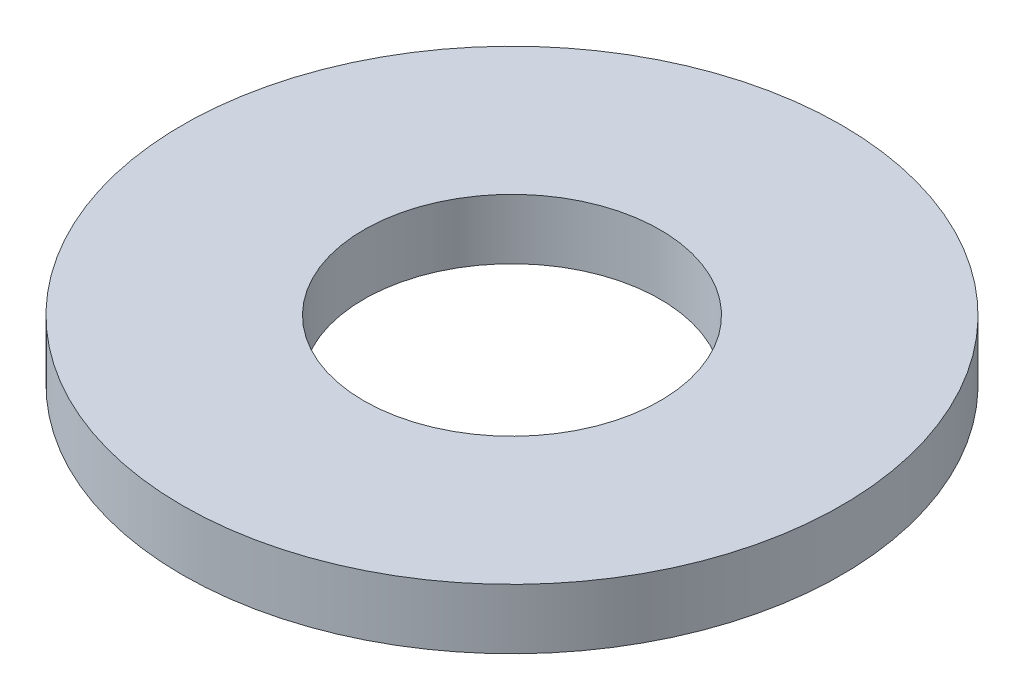
ISO-10303-21;
HEADER;
FILE_DESCRIPTION(('STEP AP214'),'2;1');
FILE_NAME('part.step','',(''),(''),'','','');
FILE_SCHEMA(('AUTOMOTIVE_DESIGN { 1 0 10303 214 1 1 1 1 }'));
ENDSEC;
DATA;
#1=APPLICATION_CONTEXT('core data for automotive mechanical design processes');
#2=APPLICATION_PROTOCOL_DEFINITION('international standard','automotive_design',2000,#1);
#3=PRODUCT_CONTEXT('',#1,'mechanical');
#4=PRODUCT('Part','Part','',(#3));
#5=PRODUCT_RELATED_PRODUCT_CATEGORY('part','',(#4));
#6=PRODUCT_DEFINITION_FORMATION('','',#4);
#7=PRODUCT_DEFINITION_CONTEXT('part definition',#1,'design');
#8=PRODUCT_DEFINITION('design','',#6,#7);
#9=PRODUCT_DEFINITION_SHAPE('','',#8);
#10=(LENGTH_UNIT() NAMED_UNIT(*) SI_UNIT(.MILLI.,.METRE.));
#11=(NAMED_UNIT(*) PLANE_ANGLE_UNIT() SI_UNIT($,.RADIAN.));
#12=(NAMED_UNIT(*) SI_UNIT($,.STERADIAN.) SOLID_ANGLE_UNIT());
#13=UNCERTAINTY_MEASURE_WITH_UNIT(LENGTH_MEASURE(1.E-05),#10,'distance_accuracy_value','');
#14=(GEOMETRIC_REPRESENTATION_CONTEXT(3) GLOBAL_UNCERTAINTY_ASSIGNED_CONTEXT((#13)) GLOBAL_UNIT_ASSIGNED_CONTEXT((#10,
#11,#12)) REPRESENTATION_CONTEXT('',''));
#15=CARTESIAN_POINT('',(0.,0.,0.));
#16=DIRECTION('',(0.,0.,1.));
#17=DIRECTION('',(1.,0.,0.));
#18=AXIS2_PLACEMENT_3D('',#15,#16,#17);
#19=CARTESIAN_POINT('',(0.,0.,0.));
#20=DIRECTION('',(0.,1.,0.));
#21=DIRECTION('',(0.,0.,1.));
#22=AXIS2_PLACEMENT_3D('',#19,#20,#21);
#23=PLANE('',#22);
#24=CARTESIAN_POINT('',(0.,0.,0.));
#25=DIRECTION('',(0.,1.,0.));
#26=DIRECTION('',(0.,0.,1.));
#27=AXIS2_PLACEMENT_3D('',#24,#25,#26);
#28=CIRCLE('',#27,3.5687);
#29=CARTESIAN_POINT('',(0.,0.,3.5687));
#30=VERTEX_POINT('',#29);
#31=EDGE_CURVE('E26',#30,#30,#28,.T.);
#32=ORIENTED_EDGE('',*,*,#31,.T.);
#33=EDGE_LOOP('',(#32));
#34=FACE_BOUND('',#33,.T.);
#35=CARTESIAN_POINT('',(0.,0.,0.));
#36=DIRECTION('',(0.,-1.,0.));
#37=DIRECTION('',(0.,0.,-1.));
#38=AXIS2_PLACEMENT_3D('',#35,#36,#37);
#39=CIRCLE('',#38,7.9375);
#40=CARTESIAN_POINT('',(0.,0.,-7.9375));
#41=VERTEX_POINT('',#40);
#42=EDGE_CURVE('E17',#41,#41,#39,.F.);
#43=ORIENTED_EDGE('',*,*,#42,.F.);
#44=EDGE_LOOP('',(#43));
#45=FACE_BOUND('',#44,.T.);
#46=ADVANCED_FACE('F14',(#34,#45),#23,.F.);
#47=CARTESIAN_POINT('',(0.,1.4478,0.));
#48=DIRECTION('',(0.,-1.,0.));
#49=DIRECTION('',(0.,0.,-1.));
#50=AXIS2_PLACEMENT_3D('',#47,#48,#49);
#51=CYLINDRICAL_SURFACE('',#50,7.9375);
#52=ORIENTED_EDGE('',*,*,#42,.T.);
#53=EDGE_LOOP('',(#52));
#54=FACE_BOUND('',#53,.T.);
#55=CARTESIAN_POINT('',(0.,1.4478,0.));
#56=DIRECTION('',(0.,-1.,0.));
#57=DIRECTION('',(0.,0.,-1.));
#58=AXIS2_PLACEMENT_3D('',#55,#56,#57);
#59=CIRCLE('',#58,7.9375);
#60=CARTESIAN_POINT('',(0.,1.4478,-7.9375));
#61=VERTEX_POINT('',#60);
#62=EDGE_CURVE('E21',#61,#61,#59,.F.);
#63=ORIENTED_EDGE('',*,*,#62,.F.);
#64=EDGE_LOOP('',(#63));
#65=FACE_BOUND('',#64,.T.);
#66=ADVANCED_FACE('F34',(#54,#65),#51,.T.);
#67=CARTESIAN_POINT('',(0.,0.,0.));
#68=DIRECTION('',(0.,1.,0.));
#69=DIRECTION('',(0.,0.,1.));
#70=AXIS2_PLACEMENT_3D('',#67,#68,#69);
#71=CYLINDRICAL_SURFACE('',#70,3.5687);
#72=CARTESIAN_POINT('',(0.,1.4478,0.));
#73=DIRECTION('',(0.,1.,0.));
#74=DIRECTION('',(0.,0.,1.));
#75=AXIS2_PLACEMENT_3D('',#72,#73,#74);
#76=CIRCLE('',#75,3.5687);
#77=CARTESIAN_POINT('',(0.,1.4478,3.5687));
#78=VERTEX_POINT('',#77);
#79=EDGE_CURVE('E10',#78,#78,#76,.F.);
#80=ORIENTED_EDGE('',*,*,#79,.F.);
#81=EDGE_LOOP('',(#80));
#82=FACE_BOUND('',#81,.T.);
#83=ORIENTED_EDGE('',*,*,#31,.F.);
#84=EDGE_LOOP('',(#83));
#85=FACE_BOUND('',#84,.T.);
#86=ADVANCED_FACE('F42',(#82,#85),#71,.F.);
#87=CARTESIAN_POINT('',(0.,1.4478,0.));
#88=DIRECTION('',(0.,1.,0.));
#89=DIRECTION('',(0.,0.,1.));
#90=AXIS2_PLACEMENT_3D('',#87,#88,#89);
#91=PLANE('',#90);
#92=ORIENTED_EDGE('',*,*,#79,.T.);
#93=EDGE_LOOP('',(#92));
#94=FACE_BOUND('',#93,.T.);
#95=ORIENTED_EDGE('',*,*,#62,.T.);
#96=EDGE_LOOP('',(#95));
#97=FACE_BOUND('',#96,.T.);
#98=ADVANCED_FACE('F43',(#94,#97),#91,.T.);
#99=CLOSED_SHELL('',(#46,#66,#86,#98));
#100=MANIFOLD_SOLID_BREP('B1',#99);
#101=ADVANCED_BREP_SHAPE_REPRESENTATION('',(#18,#100),#14);
#102=SHAPE_DEFINITION_REPRESENTATION(#9,#101);
ENDSEC;
END-ISO-10303-21;
